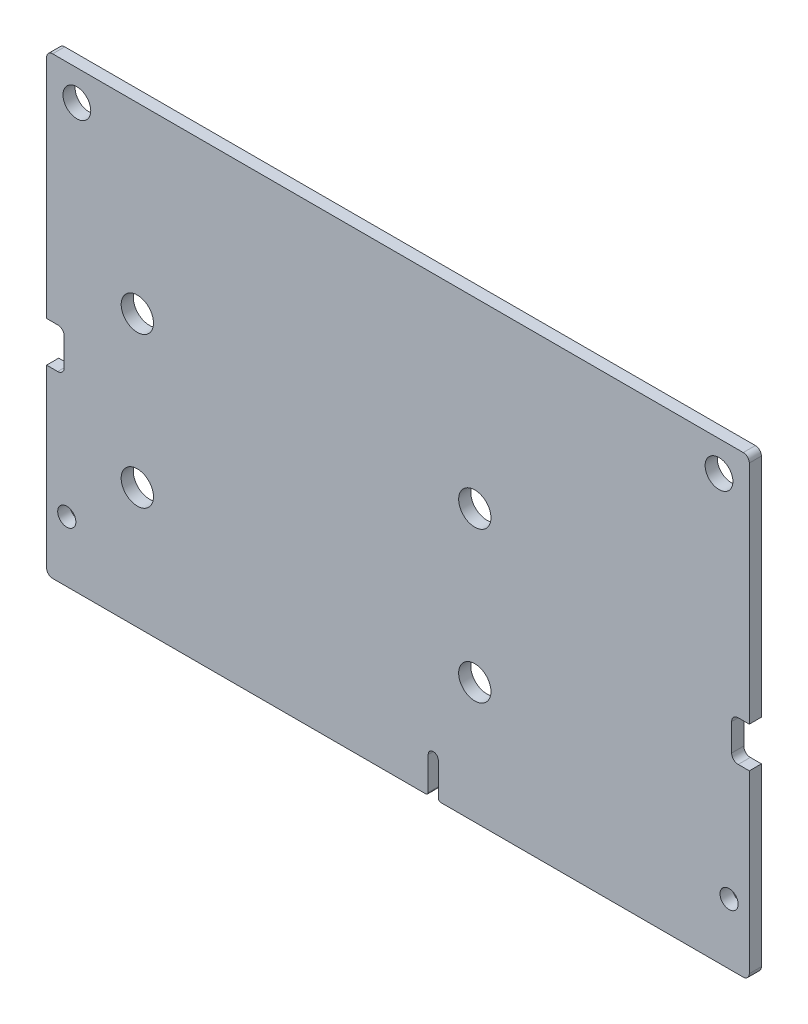
ISO-10303-21;
HEADER;
FILE_DESCRIPTION(('STEP AP214'),'2;1');
FILE_NAME('part.step','',(''),(''),'','','');
FILE_SCHEMA(('AUTOMOTIVE_DESIGN { 1 0 10303 214 1 1 1 1 }'));
ENDSEC;
DATA;
#1=APPLICATION_CONTEXT('core data for automotive mechanical design processes');
#2=APPLICATION_PROTOCOL_DEFINITION('international standard','automotive_design',2000,#1);
#3=PRODUCT_CONTEXT('',#1,'mechanical');
#4=PRODUCT('Part','Part','',(#3));
#5=PRODUCT_RELATED_PRODUCT_CATEGORY('part','',(#4));
#6=PRODUCT_DEFINITION_FORMATION('','',#4);
#7=PRODUCT_DEFINITION_CONTEXT('part definition',#1,'design');
#8=PRODUCT_DEFINITION('design','',#6,#7);
#9=PRODUCT_DEFINITION_SHAPE('','',#8);
#10=(LENGTH_UNIT() NAMED_UNIT(*) SI_UNIT(.MILLI.,.METRE.));
#11=(NAMED_UNIT(*) PLANE_ANGLE_UNIT() SI_UNIT($,.RADIAN.));
#12=(NAMED_UNIT(*) SI_UNIT($,.STERADIAN.) SOLID_ANGLE_UNIT());
#13=UNCERTAINTY_MEASURE_WITH_UNIT(LENGTH_MEASURE(1.E-05),#10,'distance_accuracy_value','');
#14=(GEOMETRIC_REPRESENTATION_CONTEXT(3) GLOBAL_UNCERTAINTY_ASSIGNED_CONTEXT((#13)) GLOBAL_UNIT_ASSIGNED_CONTEXT((#10,
#11,#12)) REPRESENTATION_CONTEXT('',''));
#15=CARTESIAN_POINT('',(0.,0.,0.));
#16=DIRECTION('',(0.,0.,1.));
#17=DIRECTION('',(1.,0.,0.));
#18=AXIS2_PLACEMENT_3D('',#15,#16,#17);
#19=CARTESIAN_POINT('',(0.,0.,1.2));
#20=DIRECTION('',(0.,0.,1.));
#21=DIRECTION('',(1.,0.,0.));
#22=AXIS2_PLACEMENT_3D('',#19,#20,#21);
#23=PLANE('',#22);
#24=CARTESIAN_POINT('',(64.6,36.,1.2));
#25=DIRECTION('',(0.,0.,1.));
#26=DIRECTION('',(1.,0.,0.));
#27=AXIS2_PLACEMENT_3D('',#24,#25,#26);
#28=CIRCLE('',#27,1.375);
#29=CARTESIAN_POINT('',(65.975,36.,1.2));
#30=VERTEX_POINT('',#29);
#31=EDGE_CURVE('E439',#30,#30,#28,.F.);
#32=ORIENTED_EDGE('',*,*,#31,.T.);
#33=EDGE_LOOP('',(#32));
#34=FACE_BOUND('',#33,.T.);
#35=CARTESIAN_POINT('',(1.,36.,1.2));
#36=DIRECTION('',(0.,0.,1.));
#37=DIRECTION('',(1.,0.,0.));
#38=AXIS2_PLACEMENT_3D('',#35,#36,#37);
#39=CIRCLE('',#38,1.375);
#40=CARTESIAN_POINT('',(2.375,36.,1.2));
#41=VERTEX_POINT('',#40);
#42=EDGE_CURVE('E442',#41,#41,#39,.F.);
#43=ORIENTED_EDGE('',*,*,#42,.T.);
#44=EDGE_LOOP('',(#43));
#45=FACE_BOUND('',#44,.T.);
#46=CARTESIAN_POINT('',(40.41293346554,5.998154895188,1.2));
#47=DIRECTION('',(0.,0.,-1.));
#48=DIRECTION('',(-1.,0.,0.));
#49=AXIS2_PLACEMENT_3D('',#46,#47,#48);
#50=CIRCLE('',#49,1.6);
#51=CARTESIAN_POINT('',(38.81293346554,5.998154895188,1.2));
#52=VERTEX_POINT('',#51);
#53=EDGE_CURVE('E445',#52,#52,#50,.T.);
#54=ORIENTED_EDGE('',*,*,#53,.T.);
#55=EDGE_LOOP('',(#54));
#56=FACE_BOUND('',#55,.T.);
#57=CARTESIAN_POINT('',(40.41293346554,20.90184510481,1.2));
#58=DIRECTION('',(0.,0.,-1.));
#59=DIRECTION('',(-1.,0.,0.));
#60=AXIS2_PLACEMENT_3D('',#57,#58,#59);
#61=CIRCLE('',#60,1.6);
#62=CARTESIAN_POINT('',(38.81293346554,20.90184510481,1.2));
#63=VERTEX_POINT('',#62);
#64=EDGE_CURVE('E448',#63,#63,#61,.T.);
#65=ORIENTED_EDGE('',*,*,#64,.T.);
#66=EDGE_LOOP('',(#65));
#67=FACE_BOUND('',#66,.T.);
#68=CARTESIAN_POINT('',(6.987066534462,20.90184510481,1.2));
#69=DIRECTION('',(0.,0.,-1.));
#70=DIRECTION('',(-1.,0.,0.));
#71=AXIS2_PLACEMENT_3D('',#68,#69,#70);
#72=CIRCLE('',#71,1.6);
#73=CARTESIAN_POINT('',(5.387066534462,20.90184510481,1.2));
#74=VERTEX_POINT('',#73);
#75=EDGE_CURVE('E451',#74,#74,#72,.T.);
#76=ORIENTED_EDGE('',*,*,#75,.T.);
#77=EDGE_LOOP('',(#76));
#78=FACE_BOUND('',#77,.T.);
#79=CARTESIAN_POINT('',(6.987066534462,5.998154895188,1.2));
#80=DIRECTION('',(0.,0.,-1.));
#81=DIRECTION('',(-1.,0.,0.));
#82=AXIS2_PLACEMENT_3D('',#79,#80,#81);
#83=CIRCLE('',#82,1.6);
#84=CARTESIAN_POINT('',(5.387066534462,5.998154895188,1.2));
#85=VERTEX_POINT('',#84);
#86=EDGE_CURVE('E454',#85,#85,#83,.T.);
#87=ORIENTED_EDGE('',*,*,#86,.T.);
#88=EDGE_LOOP('',(#87));
#89=FACE_BOUND('',#88,.T.);
#90=CARTESIAN_POINT('',(0.,0.,1.2));
#91=DIRECTION('',(0.,0.,1.));
#92=DIRECTION('',(1.,0.,0.));
#93=AXIS2_PLACEMENT_3D('',#90,#91,#92);
#94=CIRCLE('',#93,0.9);
#95=CARTESIAN_POINT('',(0.9,0.,1.2));
#96=VERTEX_POINT('',#95);
#97=EDGE_CURVE('E457',#96,#96,#94,.F.);
#98=ORIENTED_EDGE('',*,*,#97,.T.);
#99=EDGE_LOOP('',(#98));
#100=FACE_BOUND('',#99,.T.);
#101=CARTESIAN_POINT('',(65.6,0.,1.2));
#102=DIRECTION('',(0.,0.,1.));
#103=DIRECTION('',(1.,0.,0.));
#104=AXIS2_PLACEMENT_3D('',#101,#102,#103);
#105=CIRCLE('',#104,0.9);
#106=CARTESIAN_POINT('',(66.5,0.,1.2));
#107=VERTEX_POINT('',#106);
#108=EDGE_CURVE('E290',#107,#107,#105,.F.);
#109=ORIENTED_EDGE('',*,*,#108,.T.);
#110=EDGE_LOOP('',(#109));
#111=FACE_BOUND('',#110,.T.);
#112=DIRECTION('',(1.,0.,0.));
#113=VECTOR('',#112,1.);
#114=CARTESIAN_POINT('',(67.6,39.,1.2));
#115=LINE('',#114,#113);
#116=CARTESIAN_POINT('',(-1.4,39.,1.2));
#117=VERTEX_POINT('',#116);
#118=CARTESIAN_POINT('',(67.,39.,1.2));
#119=VERTEX_POINT('',#118);
#120=EDGE_CURVE('E287',#117,#119,#115,.T.);
#121=ORIENTED_EDGE('',*,*,#120,.F.);
#122=CARTESIAN_POINT('',(-1.4,38.4,1.2));
#123=DIRECTION('',(0.,0.,-1.));
#124=DIRECTION('',(-1.,0.,0.));
#125=AXIS2_PLACEMENT_3D('',#122,#123,#124);
#126=CIRCLE('',#125,0.6);
#127=CARTESIAN_POINT('',(-2.,38.4,1.2));
#128=VERTEX_POINT('',#127);
#129=EDGE_CURVE('E20',#128,#117,#126,.T.);
#130=ORIENTED_EDGE('',*,*,#129,.F.);
#131=DIRECTION('',(0.,1.,0.));
#132=VECTOR('',#131,1.);
#133=CARTESIAN_POINT('',(-2.,39.,1.2));
#134=LINE('',#133,#132);
#135=CARTESIAN_POINT('',(-2.,16.,1.2));
#136=VERTEX_POINT('',#135);
#137=EDGE_CURVE('E172',#136,#128,#134,.T.);
#138=ORIENTED_EDGE('',*,*,#137,.F.);
#139=DIRECTION('',(1.,0.,0.));
#140=VECTOR('',#139,1.);
#141=CARTESIAN_POINT('',(-2.,16.,1.2));
#142=LINE('',#141,#140);
#143=CARTESIAN_POINT('',(-0.9,16.,1.2));
#144=VERTEX_POINT('',#143);
#145=EDGE_CURVE('E178',#144,#136,#142,.F.);
#146=ORIENTED_EDGE('',*,*,#145,.F.);
#147=CARTESIAN_POINT('',(-0.9,15.35,1.2));
#148=DIRECTION('',(0.,0.,1.));
#149=DIRECTION('',(1.,0.,0.));
#150=AXIS2_PLACEMENT_3D('',#147,#148,#149);
#151=CIRCLE('',#150,0.65);
#152=CARTESIAN_POINT('',(-0.25,15.35,1.2));
#153=VERTEX_POINT('',#152);
#154=EDGE_CURVE('E361',#144,#153,#151,.F.);
#155=ORIENTED_EDGE('',*,*,#154,.T.);
#156=DIRECTION('',(0.,1.,0.));
#157=VECTOR('',#156,1.);
#158=CARTESIAN_POINT('',(-0.25,15.35,1.2));
#159=LINE('',#158,#157);
#160=CARTESIAN_POINT('',(-0.25,12.65,1.2));
#161=VERTEX_POINT('',#160);
#162=EDGE_CURVE('E358',#161,#153,#159,.T.);
#163=ORIENTED_EDGE('',*,*,#162,.F.);
#164=CARTESIAN_POINT('',(-0.9,12.65,1.2));
#165=DIRECTION('',(0.,0.,1.));
#166=DIRECTION('',(1.,0.,0.));
#167=AXIS2_PLACEMENT_3D('',#164,#165,#166);
#168=CIRCLE('',#167,0.65);
#169=CARTESIAN_POINT('',(-0.9,12.,1.2));
#170=VERTEX_POINT('',#169);
#171=EDGE_CURVE('E355',#161,#170,#168,.F.);
#172=ORIENTED_EDGE('',*,*,#171,.T.);
#173=DIRECTION('',(1.,0.,0.));
#174=VECTOR('',#173,1.);
#175=CARTESIAN_POINT('',(-0.9,12.,1.2));
#176=LINE('',#175,#174);
#177=CARTESIAN_POINT('',(-2.,12.,1.2));
#178=VERTEX_POINT('',#177);
#179=EDGE_CURVE('E351',#178,#170,#176,.T.);
#180=ORIENTED_EDGE('',*,*,#179,.F.);
#181=DIRECTION('',(0.,1.,0.));
#182=VECTOR('',#181,1.);
#183=CARTESIAN_POINT('',(-2.,12.,1.2));
#184=LINE('',#183,#182);
#185=CARTESIAN_POINT('',(-2.,-5.4,1.2));
#186=VERTEX_POINT('',#185);
#187=EDGE_CURVE('E346',#186,#178,#184,.T.);
#188=ORIENTED_EDGE('',*,*,#187,.F.);
#189=CARTESIAN_POINT('',(-1.4,-5.4,1.2));
#190=DIRECTION('',(0.,0.,-1.));
#191=DIRECTION('',(-1.,0.,0.));
#192=AXIS2_PLACEMENT_3D('',#189,#190,#191);
#193=CIRCLE('',#192,0.6);
#194=CARTESIAN_POINT('',(-1.4,-6.,1.2));
#195=VERTEX_POINT('',#194);
#196=EDGE_CURVE('E343',#195,#186,#193,.T.);
#197=ORIENTED_EDGE('',*,*,#196,.F.);
#198=DIRECTION('',(1.,0.,0.));
#199=VECTOR('',#198,1.);
#200=CARTESIAN_POINT('',(-2.,-6.,1.2));
#201=LINE('',#200,#199);
#202=CARTESIAN_POINT('',(35.55,-6.,1.2));
#203=VERTEX_POINT('',#202);
#204=EDGE_CURVE('E340',#203,#195,#201,.F.);
#205=ORIENTED_EDGE('',*,*,#204,.F.);
#206=CARTESIAN_POINT('',(35.55,-5.75,1.2));
#207=DIRECTION('',(0.,0.,1.));
#208=DIRECTION('',(1.,0.,0.));
#209=AXIS2_PLACEMENT_3D('',#206,#207,#208);
#210=CIRCLE('',#209,0.25);
#211=CARTESIAN_POINT('',(35.8,-5.75,1.2));
#212=VERTEX_POINT('',#211);
#213=EDGE_CURVE('E337',#212,#203,#210,.F.);
#214=ORIENTED_EDGE('',*,*,#213,.F.);
#215=DIRECTION('',(0.,1.,0.));
#216=VECTOR('',#215,1.);
#217=CARTESIAN_POINT('',(35.8,-5.75,1.2));
#218=LINE('',#217,#216);
#219=CARTESIAN_POINT('',(35.8,-2.5,1.2));
#220=VERTEX_POINT('',#219);
#221=EDGE_CURVE('E334',#220,#212,#218,.F.);
#222=ORIENTED_EDGE('',*,*,#221,.F.);
#223=CARTESIAN_POINT('',(36.3,-2.5,1.2));
#224=DIRECTION('',(0.,0.,1.));
#225=DIRECTION('',(1.,0.,0.));
#226=AXIS2_PLACEMENT_3D('',#223,#224,#225);
#227=CIRCLE('',#226,0.5);
#228=CARTESIAN_POINT('',(36.8,-2.5,1.2));
#229=VERTEX_POINT('',#228);
#230=EDGE_CURVE('E331',#220,#229,#227,.F.);
#231=ORIENTED_EDGE('',*,*,#230,.T.);
#232=DIRECTION('',(0.,1.,0.));
#233=VECTOR('',#232,1.);
#234=CARTESIAN_POINT('',(36.8,-2.5,1.2));
#235=LINE('',#234,#233);
#236=CARTESIAN_POINT('',(36.8,-5.75,1.2));
#237=VERTEX_POINT('',#236);
#238=EDGE_CURVE('E327',#237,#229,#235,.T.);
#239=ORIENTED_EDGE('',*,*,#238,.F.);
#240=CARTESIAN_POINT('',(37.05,-5.75,1.2));
#241=DIRECTION('',(0.,0.,1.));
#242=DIRECTION('',(1.,0.,0.));
#243=AXIS2_PLACEMENT_3D('',#240,#241,#242);
#244=CIRCLE('',#243,0.25);
#245=CARTESIAN_POINT('',(37.05,-6.,1.2));
#246=VERTEX_POINT('',#245);
#247=EDGE_CURVE('E324',#246,#237,#244,.F.);
#248=ORIENTED_EDGE('',*,*,#247,.F.);
#249=DIRECTION('',(1.,0.,0.));
#250=VECTOR('',#249,1.);
#251=CARTESIAN_POINT('',(37.05,-6.,1.2));
#252=LINE('',#251,#250);
#253=CARTESIAN_POINT('',(67.,-6.,1.2));
#254=VERTEX_POINT('',#253);
#255=EDGE_CURVE('E321',#254,#246,#252,.F.);
#256=ORIENTED_EDGE('',*,*,#255,.F.);
#257=CARTESIAN_POINT('',(67.,-5.4,1.2));
#258=DIRECTION('',(0.,0.,-1.));
#259=DIRECTION('',(-1.,0.,0.));
#260=AXIS2_PLACEMENT_3D('',#257,#258,#259);
#261=CIRCLE('',#260,0.6);
#262=CARTESIAN_POINT('',(67.6,-5.4,1.2));
#263=VERTEX_POINT('',#262);
#264=EDGE_CURVE('E318',#263,#254,#261,.T.);
#265=ORIENTED_EDGE('',*,*,#264,.F.);
#266=DIRECTION('',(0.,1.,0.));
#267=VECTOR('',#266,1.);
#268=CARTESIAN_POINT('',(67.6,-6.,1.2));
#269=LINE('',#268,#267);
#270=CARTESIAN_POINT('',(67.6,12.,1.2));
#271=VERTEX_POINT('',#270);
#272=EDGE_CURVE('E315',#271,#263,#269,.F.);
#273=ORIENTED_EDGE('',*,*,#272,.F.);
#274=DIRECTION('',(1.,0.,0.));
#275=VECTOR('',#274,1.);
#276=CARTESIAN_POINT('',(67.6,12.,1.2));
#277=LINE('',#276,#275);
#278=CARTESIAN_POINT('',(66.5,12.,1.2));
#279=VERTEX_POINT('',#278);
#280=EDGE_CURVE('E310',#279,#271,#277,.T.);
#281=ORIENTED_EDGE('',*,*,#280,.F.);
#282=CARTESIAN_POINT('',(66.5,12.65,1.2));
#283=DIRECTION('',(0.,0.,1.));
#284=DIRECTION('',(1.,0.,0.));
#285=AXIS2_PLACEMENT_3D('',#282,#283,#284);
#286=CIRCLE('',#285,0.65);
#287=CARTESIAN_POINT('',(65.85,12.65,1.2));
#288=VERTEX_POINT('',#287);
#289=EDGE_CURVE('E307',#279,#288,#286,.F.);
#290=ORIENTED_EDGE('',*,*,#289,.T.);
#291=DIRECTION('',(0.,1.,0.));
#292=VECTOR('',#291,1.);
#293=CARTESIAN_POINT('',(65.85,12.65,1.2));
#294=LINE('',#293,#292);
#295=CARTESIAN_POINT('',(65.85,15.35,1.2));
#296=VERTEX_POINT('',#295);
#297=EDGE_CURVE('E303',#296,#288,#294,.F.);
#298=ORIENTED_EDGE('',*,*,#297,.F.);
#299=CARTESIAN_POINT('',(66.5,15.35,1.2));
#300=DIRECTION('',(0.,0.,1.));
#301=DIRECTION('',(1.,0.,0.));
#302=AXIS2_PLACEMENT_3D('',#299,#300,#301);
#303=CIRCLE('',#302,0.65);
#304=CARTESIAN_POINT('',(66.5,16.,1.2));
#305=VERTEX_POINT('',#304);
#306=EDGE_CURVE('E300',#296,#305,#303,.F.);
#307=ORIENTED_EDGE('',*,*,#306,.T.);
#308=DIRECTION('',(1.,0.,0.));
#309=VECTOR('',#308,1.);
#310=CARTESIAN_POINT('',(66.5,16.,1.2));
#311=LINE('',#310,#309);
#312=CARTESIAN_POINT('',(67.6,16.,1.2));
#313=VERTEX_POINT('',#312);
#314=EDGE_CURVE('E296',#313,#305,#311,.F.);
#315=ORIENTED_EDGE('',*,*,#314,.F.);
#316=DIRECTION('',(0.,1.,0.));
#317=VECTOR('',#316,1.);
#318=CARTESIAN_POINT('',(67.6,16.,1.2));
#319=LINE('',#318,#317);
#320=CARTESIAN_POINT('',(67.6,38.4,1.2));
#321=VERTEX_POINT('',#320);
#322=EDGE_CURVE('E201',#321,#313,#319,.F.);
#323=ORIENTED_EDGE('',*,*,#322,.F.);
#324=CARTESIAN_POINT('',(67.,38.4,1.2));
#325=DIRECTION('',(0.,0.,-1.));
#326=DIRECTION('',(-1.,0.,0.));
#327=AXIS2_PLACEMENT_3D('',#324,#325,#326);
#328=CIRCLE('',#327,0.6);
#329=EDGE_CURVE('E205',#119,#321,#328,.T.);
#330=ORIENTED_EDGE('',*,*,#329,.F.);
#331=EDGE_LOOP('',(#121,#130,#138,#146,#155,#163,#172,#180,#188,#197,#205,#214,#222,#231,#239,
#248,#256,#265,#273,#281,#290,#298,#307,#315,#323,#330));
#332=FACE_BOUND('',#331,.T.);
#333=ADVANCED_FACE('F17',(#34,#45,#56,#67,#78,#89,#100,#111,#332),#23,.T.);
#334=CARTESIAN_POINT('',(-1.4,38.4,2.76432));
#335=DIRECTION('',(0.,0.,-1.));
#336=DIRECTION('',(-1.,0.,0.));
#337=AXIS2_PLACEMENT_3D('',#334,#335,#336);
#338=CYLINDRICAL_SURFACE('',#337,0.6);
#339=DIRECTION('',(0.,0.,1.));
#340=VECTOR('',#339,1.);
#341=CARTESIAN_POINT('',(-1.4,39.,0.));
#342=LINE('',#341,#340);
#343=CARTESIAN_POINT('',(-1.4,39.,0.));
#344=VERTEX_POINT('',#343);
#345=EDGE_CURVE('E286',#344,#117,#342,.T.);
#346=ORIENTED_EDGE('',*,*,#345,.F.);
#347=CARTESIAN_POINT('',(-1.4,38.4,0.));
#348=DIRECTION('',(0.,0.,-1.));
#349=DIRECTION('',(-1.,0.,0.));
#350=AXIS2_PLACEMENT_3D('',#347,#348,#349);
#351=CIRCLE('',#350,0.6);
#352=CARTESIAN_POINT('',(-2.,38.4,0.));
#353=VERTEX_POINT('',#352);
#354=EDGE_CURVE('E282',#344,#353,#351,.F.);
#355=ORIENTED_EDGE('',*,*,#354,.T.);
#356=DIRECTION('',(0.,0.,1.));
#357=VECTOR('',#356,1.);
#358=CARTESIAN_POINT('',(-2.,38.4,0.));
#359=LINE('',#358,#357);
#360=EDGE_CURVE('E366',#128,#353,#359,.F.);
#361=ORIENTED_EDGE('',*,*,#360,.F.);
#362=ORIENTED_EDGE('',*,*,#129,.T.);
#363=EDGE_LOOP('',(#346,#355,#361,#362));
#364=FACE_BOUND('',#363,.T.);
#365=ADVANCED_FACE('F633',(#364),#338,.T.);
#366=CARTESIAN_POINT('',(-2.,39.,0.));
#367=DIRECTION('',(-1.,0.,0.));
#368=DIRECTION('',(0.,0.,1.));
#369=AXIS2_PLACEMENT_3D('',#366,#367,#368);
#370=PLANE('',#369);
#371=ORIENTED_EDGE('',*,*,#137,.T.);
#372=ORIENTED_EDGE('',*,*,#360,.T.);
#373=DIRECTION('',(0.,1.,0.));
#374=VECTOR('',#373,1.);
#375=CARTESIAN_POINT('',(-2.,0.,0.));
#376=LINE('',#375,#374);
#377=CARTESIAN_POINT('',(-2.,16.,0.));
#378=VERTEX_POINT('',#377);
#379=EDGE_CURVE('E277',#353,#378,#376,.F.);
#380=ORIENTED_EDGE('',*,*,#379,.T.);
#381=DIRECTION('',(0.,0.,-1.));
#382=VECTOR('',#381,1.);
#383=CARTESIAN_POINT('',(-2.,16.,0.));
#384=LINE('',#383,#382);
#385=EDGE_CURVE('E362',#136,#378,#384,.T.);
#386=ORIENTED_EDGE('',*,*,#385,.F.);
#387=EDGE_LOOP('',(#371,#372,#380,#386));
#388=FACE_BOUND('',#387,.T.);
#389=ADVANCED_FACE('F635',(#388),#370,.T.);
#390=CARTESIAN_POINT('',(-2.,16.,0.));
#391=DIRECTION('',(0.,-1.,0.));
#392=DIRECTION('',(0.,0.,-1.));
#393=AXIS2_PLACEMENT_3D('',#390,#391,#392);
#394=PLANE('',#393);
#395=ORIENTED_EDGE('',*,*,#385,.T.);
#396=DIRECTION('',(1.,0.,0.));
#397=VECTOR('',#396,1.);
#398=CARTESIAN_POINT('',(0.,16.,0.));
#399=LINE('',#398,#397);
#400=CARTESIAN_POINT('',(-0.9,16.,0.));
#401=VERTEX_POINT('',#400);
#402=EDGE_CURVE('E274',#378,#401,#399,.T.);
#403=ORIENTED_EDGE('',*,*,#402,.T.);
#404=DIRECTION('',(0.,0.,1.));
#405=VECTOR('',#404,1.);
#406=CARTESIAN_POINT('',(-0.9,16.,0.));
#407=LINE('',#406,#405);
#408=EDGE_CURVE('E359',#401,#144,#407,.T.);
#409=ORIENTED_EDGE('',*,*,#408,.T.);
#410=ORIENTED_EDGE('',*,*,#145,.T.);
#411=EDGE_LOOP('',(#395,#403,#409,#410));
#412=FACE_BOUND('',#411,.T.);
#413=ADVANCED_FACE('F636',(#412),#394,.T.);
#414=CARTESIAN_POINT('',(-0.9,15.35,0.));
#415=DIRECTION('',(0.,0.,1.));
#416=DIRECTION('',(1.,0.,0.));
#417=AXIS2_PLACEMENT_3D('',#414,#415,#416);
#418=CYLINDRICAL_SURFACE('',#417,0.65);
#419=ORIENTED_EDGE('',*,*,#154,.F.);
#420=ORIENTED_EDGE('',*,*,#408,.F.);
#421=CARTESIAN_POINT('',(-0.9,15.35,0.));
#422=DIRECTION('',(0.,0.,1.));
#423=DIRECTION('',(1.,0.,0.));
#424=AXIS2_PLACEMENT_3D('',#421,#422,#423);
#425=CIRCLE('',#424,0.65);
#426=CARTESIAN_POINT('',(-0.25,15.35,0.));
#427=VERTEX_POINT('',#426);
#428=EDGE_CURVE('E273',#401,#427,#425,.F.);
#429=ORIENTED_EDGE('',*,*,#428,.T.);
#430=DIRECTION('',(0.,0.,1.));
#431=VECTOR('',#430,1.);
#432=CARTESIAN_POINT('',(-0.25,15.35,0.));
#433=LINE('',#432,#431);
#434=EDGE_CURVE('E356',#153,#427,#433,.F.);
#435=ORIENTED_EDGE('',*,*,#434,.F.);
#436=EDGE_LOOP('',(#419,#420,#429,#435));
#437=FACE_BOUND('',#436,.T.);
#438=ADVANCED_FACE('F481',(#437),#418,.F.);
#439=CARTESIAN_POINT('',(-0.25,15.35,0.));
#440=DIRECTION('',(-1.,0.,0.));
#441=DIRECTION('',(0.,0.,1.));
#442=AXIS2_PLACEMENT_3D('',#439,#440,#441);
#443=PLANE('',#442);
#444=ORIENTED_EDGE('',*,*,#434,.T.);
#445=DIRECTION('',(0.,1.,0.));
#446=VECTOR('',#445,1.);
#447=CARTESIAN_POINT('',(-0.25,0.,0.));
#448=LINE('',#447,#446);
#449=CARTESIAN_POINT('',(-0.25,12.65,0.));
#450=VERTEX_POINT('',#449);
#451=EDGE_CURVE('E270',#427,#450,#448,.F.);
#452=ORIENTED_EDGE('',*,*,#451,.T.);
#453=DIRECTION('',(0.,0.,1.));
#454=VECTOR('',#453,1.);
#455=CARTESIAN_POINT('',(-0.25,12.65,0.));
#456=LINE('',#455,#454);
#457=EDGE_CURVE('E352',#450,#161,#456,.T.);
#458=ORIENTED_EDGE('',*,*,#457,.T.);
#459=ORIENTED_EDGE('',*,*,#162,.T.);
#460=EDGE_LOOP('',(#444,#452,#458,#459));
#461=FACE_BOUND('',#460,.T.);
#462=ADVANCED_FACE('F485',(#461),#443,.T.);
#463=CARTESIAN_POINT('',(-0.9,12.65,0.));
#464=DIRECTION('',(0.,0.,1.));
#465=DIRECTION('',(1.,0.,0.));
#466=AXIS2_PLACEMENT_3D('',#463,#464,#465);
#467=CYLINDRICAL_SURFACE('',#466,0.65);
#468=ORIENTED_EDGE('',*,*,#171,.F.);
#469=ORIENTED_EDGE('',*,*,#457,.F.);
#470=CARTESIAN_POINT('',(-0.9,12.65,0.));
#471=DIRECTION('',(0.,0.,1.));
#472=DIRECTION('',(1.,0.,0.));
#473=AXIS2_PLACEMENT_3D('',#470,#471,#472);
#474=CIRCLE('',#473,0.65);
#475=CARTESIAN_POINT('',(-0.9,12.,0.));
#476=VERTEX_POINT('',#475);
#477=EDGE_CURVE('E267',#450,#476,#474,.F.);
#478=ORIENTED_EDGE('',*,*,#477,.T.);
#479=DIRECTION('',(0.,0.,1.));
#480=VECTOR('',#479,1.);
#481=CARTESIAN_POINT('',(-0.9,12.,0.));
#482=LINE('',#481,#480);
#483=EDGE_CURVE('E349',#170,#476,#482,.F.);
#484=ORIENTED_EDGE('',*,*,#483,.F.);
#485=EDGE_LOOP('',(#468,#469,#478,#484));
#486=FACE_BOUND('',#485,.T.);
#487=ADVANCED_FACE('F492',(#486),#467,.F.);
#488=CARTESIAN_POINT('',(-0.9,12.,0.));
#489=DIRECTION('',(0.,1.,0.));
#490=DIRECTION('',(0.,0.,1.));
#491=AXIS2_PLACEMENT_3D('',#488,#489,#490);
#492=PLANE('',#491);
#493=ORIENTED_EDGE('',*,*,#483,.T.);
#494=DIRECTION('',(1.,0.,0.));
#495=VECTOR('',#494,1.);
#496=CARTESIAN_POINT('',(0.,12.,0.));
#497=LINE('',#496,#495);
#498=CARTESIAN_POINT('',(-2.,12.,0.));
#499=VERTEX_POINT('',#498);
#500=EDGE_CURVE('E262',#476,#499,#497,.F.);
#501=ORIENTED_EDGE('',*,*,#500,.T.);
#502=DIRECTION('',(0.,0.,1.));
#503=VECTOR('',#502,1.);
#504=CARTESIAN_POINT('',(-2.,12.,0.));
#505=LINE('',#504,#503);
#506=EDGE_CURVE('E344',#178,#499,#505,.F.);
#507=ORIENTED_EDGE('',*,*,#506,.F.);
#508=ORIENTED_EDGE('',*,*,#179,.T.);
#509=EDGE_LOOP('',(#493,#501,#507,#508));
#510=FACE_BOUND('',#509,.T.);
#511=ADVANCED_FACE('F499',(#510),#492,.T.);
#512=CARTESIAN_POINT('',(-2.,12.,0.));
#513=DIRECTION('',(-1.,0.,0.));
#514=DIRECTION('',(0.,0.,1.));
#515=AXIS2_PLACEMENT_3D('',#512,#513,#514);
#516=PLANE('',#515);
#517=DIRECTION('',(0.,1.,0.));
#518=VECTOR('',#517,1.);
#519=CARTESIAN_POINT('',(-2.,0.,0.));
#520=LINE('',#519,#518);
#521=CARTESIAN_POINT('',(-2.,-5.4,0.));
#522=VERTEX_POINT('',#521);
#523=EDGE_CURVE('E259',#499,#522,#520,.F.);
#524=ORIENTED_EDGE('',*,*,#523,.T.);
#525=DIRECTION('',(0.,0.,-1.));
#526=VECTOR('',#525,1.);
#527=CARTESIAN_POINT('',(-2.,-5.4,2.76432));
#528=LINE('',#527,#526);
#529=EDGE_CURVE('E341',#186,#522,#528,.T.);
#530=ORIENTED_EDGE('',*,*,#529,.F.);
#531=ORIENTED_EDGE('',*,*,#187,.T.);
#532=ORIENTED_EDGE('',*,*,#506,.T.);
#533=EDGE_LOOP('',(#524,#530,#531,#532));
#534=FACE_BOUND('',#533,.T.);
#535=ADVANCED_FACE('F501',(#534),#516,.T.);
#536=CARTESIAN_POINT('',(-1.4,-5.4,2.76432));
#537=DIRECTION('',(0.,0.,-1.));
#538=DIRECTION('',(-1.,0.,0.));
#539=AXIS2_PLACEMENT_3D('',#536,#537,#538);
#540=CYLINDRICAL_SURFACE('',#539,0.6);
#541=ORIENTED_EDGE('',*,*,#529,.T.);
#542=CARTESIAN_POINT('',(-1.4,-5.4,0.));
#543=DIRECTION('',(0.,0.,-1.));
#544=DIRECTION('',(-1.,0.,0.));
#545=AXIS2_PLACEMENT_3D('',#542,#543,#544);
#546=CIRCLE('',#545,0.6);
#547=CARTESIAN_POINT('',(-1.4,-6.,0.));
#548=VERTEX_POINT('',#547);
#549=EDGE_CURVE('E258',#522,#548,#546,.F.);
#550=ORIENTED_EDGE('',*,*,#549,.T.);
#551=DIRECTION('',(0.,0.,-1.));
#552=VECTOR('',#551,1.);
#553=CARTESIAN_POINT('',(-1.4,-6.,0.));
#554=LINE('',#553,#552);
#555=EDGE_CURVE('E338',#195,#548,#554,.T.);
#556=ORIENTED_EDGE('',*,*,#555,.F.);
#557=ORIENTED_EDGE('',*,*,#196,.T.);
#558=EDGE_LOOP('',(#541,#550,#556,#557));
#559=FACE_BOUND('',#558,.T.);
#560=ADVANCED_FACE('F507',(#559),#540,.T.);
#561=CARTESIAN_POINT('',(-2.,-6.,0.));
#562=DIRECTION('',(0.,-1.,0.));
#563=DIRECTION('',(0.,0.,-1.));
#564=AXIS2_PLACEMENT_3D('',#561,#562,#563);
#565=PLANE('',#564);
#566=ORIENTED_EDGE('',*,*,#555,.T.);
#567=DIRECTION('',(1.,0.,0.));
#568=VECTOR('',#567,1.);
#569=CARTESIAN_POINT('',(0.,-6.,0.));
#570=LINE('',#569,#568);
#571=CARTESIAN_POINT('',(35.55,-6.,0.));
#572=VERTEX_POINT('',#571);
#573=EDGE_CURVE('E255',#548,#572,#570,.T.);
#574=ORIENTED_EDGE('',*,*,#573,.T.);
#575=DIRECTION('',(0.,0.,1.));
#576=VECTOR('',#575,1.);
#577=CARTESIAN_POINT('',(35.55,-6.,0.));
#578=LINE('',#577,#576);
#579=EDGE_CURVE('E335',#203,#572,#578,.F.);
#580=ORIENTED_EDGE('',*,*,#579,.F.);
#581=ORIENTED_EDGE('',*,*,#204,.T.);
#582=EDGE_LOOP('',(#566,#574,#580,#581));
#583=FACE_BOUND('',#582,.T.);
#584=ADVANCED_FACE('F513',(#583),#565,.T.);
#585=CARTESIAN_POINT('',(35.55,-5.75,0.));
#586=DIRECTION('',(0.,0.,1.));
#587=DIRECTION('',(1.,0.,0.));
#588=AXIS2_PLACEMENT_3D('',#585,#586,#587);
#589=CYLINDRICAL_SURFACE('',#588,0.25);
#590=ORIENTED_EDGE('',*,*,#579,.T.);
#591=CARTESIAN_POINT('',(35.55,-5.75,0.));
#592=DIRECTION('',(0.,0.,1.));
#593=DIRECTION('',(1.,0.,0.));
#594=AXIS2_PLACEMENT_3D('',#591,#592,#593);
#595=CIRCLE('',#594,0.25);
#596=CARTESIAN_POINT('',(35.8,-5.75,0.));
#597=VERTEX_POINT('',#596);
#598=EDGE_CURVE('E254',#572,#597,#595,.T.);
#599=ORIENTED_EDGE('',*,*,#598,.T.);
#600=DIRECTION('',(0.,0.,-1.));
#601=VECTOR('',#600,1.);
#602=CARTESIAN_POINT('',(35.8,-5.75,0.));
#603=LINE('',#602,#601);
#604=EDGE_CURVE('E332',#212,#597,#603,.T.);
#605=ORIENTED_EDGE('',*,*,#604,.F.);
#606=ORIENTED_EDGE('',*,*,#213,.T.);
#607=EDGE_LOOP('',(#590,#599,#605,#606));
#608=FACE_BOUND('',#607,.T.);
#609=ADVANCED_FACE('F515',(#608),#589,.T.);
#610=CARTESIAN_POINT('',(35.8,-5.75,0.));
#611=DIRECTION('',(1.,0.,0.));
#612=DIRECTION('',(0.,0.,-1.));
#613=AXIS2_PLACEMENT_3D('',#610,#611,#612);
#614=PLANE('',#613);
#615=ORIENTED_EDGE('',*,*,#604,.T.);
#616=DIRECTION('',(0.,1.,0.));
#617=VECTOR('',#616,1.);
#618=CARTESIAN_POINT('',(35.8,0.,0.));
#619=LINE('',#618,#617);
#620=CARTESIAN_POINT('',(35.8,-2.5,0.));
#621=VERTEX_POINT('',#620);
#622=EDGE_CURVE('E251',#597,#621,#619,.T.);
#623=ORIENTED_EDGE('',*,*,#622,.T.);
#624=DIRECTION('',(0.,0.,1.));
#625=VECTOR('',#624,1.);
#626=CARTESIAN_POINT('',(35.8,-2.5,0.));
#627=LINE('',#626,#625);
#628=EDGE_CURVE('E328',#621,#220,#627,.T.);
#629=ORIENTED_EDGE('',*,*,#628,.T.);
#630=ORIENTED_EDGE('',*,*,#221,.T.);
#631=EDGE_LOOP('',(#615,#623,#629,#630));
#632=FACE_BOUND('',#631,.T.);
#633=ADVANCED_FACE('F520',(#632),#614,.T.);
#634=CARTESIAN_POINT('',(36.3,-2.5,0.));
#635=DIRECTION('',(0.,0.,1.));
#636=DIRECTION('',(1.,0.,0.));
#637=AXIS2_PLACEMENT_3D('',#634,#635,#636);
#638=CYLINDRICAL_SURFACE('',#637,0.5);
#639=ORIENTED_EDGE('',*,*,#230,.F.);
#640=ORIENTED_EDGE('',*,*,#628,.F.);
#641=CARTESIAN_POINT('',(36.3,-2.5,0.));
#642=DIRECTION('',(0.,0.,1.));
#643=DIRECTION('',(1.,0.,0.));
#644=AXIS2_PLACEMENT_3D('',#641,#642,#643);
#645=CIRCLE('',#644,0.5);
#646=CARTESIAN_POINT('',(36.8,-2.5,0.));
#647=VERTEX_POINT('',#646);
#648=EDGE_CURVE('E250',#621,#647,#645,.F.);
#649=ORIENTED_EDGE('',*,*,#648,.T.);
#650=DIRECTION('',(0.,0.,1.));
#651=VECTOR('',#650,1.);
#652=CARTESIAN_POINT('',(36.8,-2.5,0.));
#653=LINE('',#652,#651);
#654=EDGE_CURVE('E325',#229,#647,#653,.F.);
#655=ORIENTED_EDGE('',*,*,#654,.F.);
#656=EDGE_LOOP('',(#639,#640,#649,#655));
#657=FACE_BOUND('',#656,.T.);
#658=ADVANCED_FACE('F525',(#657),#638,.F.);
#659=CARTESIAN_POINT('',(36.8,-2.5,0.));
#660=DIRECTION('',(-1.,0.,0.));
#661=DIRECTION('',(0.,0.,1.));
#662=AXIS2_PLACEMENT_3D('',#659,#660,#661);
#663=PLANE('',#662);
#664=ORIENTED_EDGE('',*,*,#654,.T.);
#665=DIRECTION('',(0.,1.,0.));
#666=VECTOR('',#665,1.);
#667=CARTESIAN_POINT('',(36.8,0.,0.));
#668=LINE('',#667,#666);
#669=CARTESIAN_POINT('',(36.8,-5.75,0.));
#670=VERTEX_POINT('',#669);
#671=EDGE_CURVE('E247',#647,#670,#668,.F.);
#672=ORIENTED_EDGE('',*,*,#671,.T.);
#673=DIRECTION('',(0.,0.,1.));
#674=VECTOR('',#673,1.);
#675=CARTESIAN_POINT('',(36.8,-5.75,0.));
#676=LINE('',#675,#674);
#677=EDGE_CURVE('E322',#237,#670,#676,.F.);
#678=ORIENTED_EDGE('',*,*,#677,.F.);
#679=ORIENTED_EDGE('',*,*,#238,.T.);
#680=EDGE_LOOP('',(#664,#672,#678,#679));
#681=FACE_BOUND('',#680,.T.);
#682=ADVANCED_FACE('F527',(#681),#663,.T.);
#683=CARTESIAN_POINT('',(37.05,-5.75,0.));
#684=DIRECTION('',(0.,0.,1.));
#685=DIRECTION('',(1.,0.,0.));
#686=AXIS2_PLACEMENT_3D('',#683,#684,#685);
#687=CYLINDRICAL_SURFACE('',#686,0.25);
#688=ORIENTED_EDGE('',*,*,#677,.T.);
#689=CARTESIAN_POINT('',(37.05,-5.75,0.));
#690=DIRECTION('',(0.,0.,1.));
#691=DIRECTION('',(1.,0.,0.));
#692=AXIS2_PLACEMENT_3D('',#689,#690,#691);
#693=CIRCLE('',#692,0.25);
#694=CARTESIAN_POINT('',(37.05,-6.,0.));
#695=VERTEX_POINT('',#694);
#696=EDGE_CURVE('E246',#670,#695,#693,.T.);
#697=ORIENTED_EDGE('',*,*,#696,.T.);
#698=DIRECTION('',(0.,0.,-1.));
#699=VECTOR('',#698,1.);
#700=CARTESIAN_POINT('',(37.05,-6.,0.));
#701=LINE('',#700,#699);
#702=EDGE_CURVE('E319',#246,#695,#701,.T.);
#703=ORIENTED_EDGE('',*,*,#702,.F.);
#704=ORIENTED_EDGE('',*,*,#247,.T.);
#705=EDGE_LOOP('',(#688,#697,#703,#704));
#706=FACE_BOUND('',#705,.T.);
#707=ADVANCED_FACE('F534',(#706),#687,.T.);
#708=CARTESIAN_POINT('',(37.05,-6.,0.));
#709=DIRECTION('',(0.,-1.,0.));
#710=DIRECTION('',(0.,0.,-1.));
#711=AXIS2_PLACEMENT_3D('',#708,#709,#710);
#712=PLANE('',#711);
#713=DIRECTION('',(1.,0.,0.));
#714=VECTOR('',#713,1.);
#715=CARTESIAN_POINT('',(0.,-6.,0.));
#716=LINE('',#715,#714);
#717=CARTESIAN_POINT('',(67.,-6.,0.));
#718=VERTEX_POINT('',#717);
#719=EDGE_CURVE('E243',#695,#718,#716,.T.);
#720=ORIENTED_EDGE('',*,*,#719,.T.);
#721=DIRECTION('',(0.,0.,-1.));
#722=VECTOR('',#721,1.);
#723=CARTESIAN_POINT('',(67.,-6.,2.76432));
#724=LINE('',#723,#722);
#725=EDGE_CURVE('E316',#254,#718,#724,.T.);
#726=ORIENTED_EDGE('',*,*,#725,.F.);
#727=ORIENTED_EDGE('',*,*,#255,.T.);
#728=ORIENTED_EDGE('',*,*,#702,.T.);
#729=EDGE_LOOP('',(#720,#726,#727,#728));
#730=FACE_BOUND('',#729,.T.);
#731=ADVANCED_FACE('F542',(#730),#712,.T.);
#732=CARTESIAN_POINT('',(67.,-5.4,2.76432));
#733=DIRECTION('',(0.,0.,-1.));
#734=DIRECTION('',(-1.,0.,0.));
#735=AXIS2_PLACEMENT_3D('',#732,#733,#734);
#736=CYLINDRICAL_SURFACE('',#735,0.6);
#737=ORIENTED_EDGE('',*,*,#725,.T.);
#738=CARTESIAN_POINT('',(67.,-5.4,0.));
#739=DIRECTION('',(0.,0.,-1.));
#740=DIRECTION('',(-1.,0.,0.));
#741=AXIS2_PLACEMENT_3D('',#738,#739,#740);
#742=CIRCLE('',#741,0.6);
#743=CARTESIAN_POINT('',(67.6,-5.4,0.));
#744=VERTEX_POINT('',#743);
#745=EDGE_CURVE('E240',#718,#744,#742,.F.);
#746=ORIENTED_EDGE('',*,*,#745,.T.);
#747=DIRECTION('',(0.,0.,-1.));
#748=VECTOR('',#747,1.);
#749=CARTESIAN_POINT('',(67.6,-5.4,0.));
#750=LINE('',#749,#748);
#751=EDGE_CURVE('E313',#263,#744,#750,.T.);
#752=ORIENTED_EDGE('',*,*,#751,.F.);
#753=ORIENTED_EDGE('',*,*,#264,.T.);
#754=EDGE_LOOP('',(#737,#746,#752,#753));
#755=FACE_BOUND('',#754,.T.);
#756=ADVANCED_FACE('F544',(#755),#736,.T.);
#757=CARTESIAN_POINT('',(67.6,-6.,0.));
#758=DIRECTION('',(1.,0.,0.));
#759=DIRECTION('',(0.,0.,-1.));
#760=AXIS2_PLACEMENT_3D('',#757,#758,#759);
#761=PLANE('',#760);
#762=ORIENTED_EDGE('',*,*,#751,.T.);
#763=DIRECTION('',(0.,1.,0.));
#764=VECTOR('',#763,1.);
#765=CARTESIAN_POINT('',(67.6,0.,0.));
#766=LINE('',#765,#764);
#767=CARTESIAN_POINT('',(67.6,12.,0.));
#768=VERTEX_POINT('',#767);
#769=EDGE_CURVE('E235',#744,#768,#766,.T.);
#770=ORIENTED_EDGE('',*,*,#769,.T.);
#771=DIRECTION('',(0.,0.,1.));
#772=VECTOR('',#771,1.);
#773=CARTESIAN_POINT('',(67.6,12.,0.));
#774=LINE('',#773,#772);
#775=EDGE_CURVE('E308',#271,#768,#774,.F.);
#776=ORIENTED_EDGE('',*,*,#775,.F.);
#777=ORIENTED_EDGE('',*,*,#272,.T.);
#778=EDGE_LOOP('',(#762,#770,#776,#777));
#779=FACE_BOUND('',#778,.T.);
#780=ADVANCED_FACE('F550',(#779),#761,.T.);
#781=CARTESIAN_POINT('',(67.6,12.,0.));
#782=DIRECTION('',(0.,1.,0.));
#783=DIRECTION('',(0.,0.,1.));
#784=AXIS2_PLACEMENT_3D('',#781,#782,#783);
#785=PLANE('',#784);
#786=ORIENTED_EDGE('',*,*,#775,.T.);
#787=DIRECTION('',(1.,0.,0.));
#788=VECTOR('',#787,1.);
#789=CARTESIAN_POINT('',(0.,12.,0.));
#790=LINE('',#789,#788);
#791=CARTESIAN_POINT('',(66.5,12.,0.));
#792=VERTEX_POINT('',#791);
#793=EDGE_CURVE('E232',#768,#792,#790,.F.);
#794=ORIENTED_EDGE('',*,*,#793,.T.);
#795=DIRECTION('',(0.,0.,1.));
#796=VECTOR('',#795,1.);
#797=CARTESIAN_POINT('',(66.5,12.,0.));
#798=LINE('',#797,#796);
#799=EDGE_CURVE('E304',#792,#279,#798,.T.);
#800=ORIENTED_EDGE('',*,*,#799,.T.);
#801=ORIENTED_EDGE('',*,*,#280,.T.);
#802=EDGE_LOOP('',(#786,#794,#800,#801));
#803=FACE_BOUND('',#802,.T.);
#804=ADVANCED_FACE('F556',(#803),#785,.T.);
#805=CARTESIAN_POINT('',(66.5,12.65,0.));
#806=DIRECTION('',(0.,0.,1.));
#807=DIRECTION('',(1.,0.,0.));
#808=AXIS2_PLACEMENT_3D('',#805,#806,#807);
#809=CYLINDRICAL_SURFACE('',#808,0.65);
#810=ORIENTED_EDGE('',*,*,#289,.F.);
#811=ORIENTED_EDGE('',*,*,#799,.F.);
#812=CARTESIAN_POINT('',(66.5,12.65,0.));
#813=DIRECTION('',(0.,0.,1.));
#814=DIRECTION('',(1.,0.,0.));
#815=AXIS2_PLACEMENT_3D('',#812,#813,#814);
#816=CIRCLE('',#815,0.65);
#817=CARTESIAN_POINT('',(65.85,12.65,0.));
#818=VERTEX_POINT('',#817);
#819=EDGE_CURVE('E231',#792,#818,#816,.F.);
#820=ORIENTED_EDGE('',*,*,#819,.T.);
#821=DIRECTION('',(0.,0.,-1.));
#822=VECTOR('',#821,1.);
#823=CARTESIAN_POINT('',(65.85,12.65,0.));
#824=LINE('',#823,#822);
#825=EDGE_CURVE('E301',#288,#818,#824,.T.);
#826=ORIENTED_EDGE('',*,*,#825,.F.);
#827=EDGE_LOOP('',(#810,#811,#820,#826));
#828=FACE_BOUND('',#827,.T.);
#829=ADVANCED_FACE('F555',(#828),#809,.F.);
#830=CARTESIAN_POINT('',(65.85,12.65,0.));
#831=DIRECTION('',(1.,0.,0.));
#832=DIRECTION('',(0.,0.,-1.));
#833=AXIS2_PLACEMENT_3D('',#830,#831,#832);
#834=PLANE('',#833);
#835=ORIENTED_EDGE('',*,*,#825,.T.);
#836=DIRECTION('',(0.,1.,0.));
#837=VECTOR('',#836,1.);
#838=CARTESIAN_POINT('',(65.85,0.,0.));
#839=LINE('',#838,#837);
#840=CARTESIAN_POINT('',(65.85,15.35,0.));
#841=VERTEX_POINT('',#840);
#842=EDGE_CURVE('E222',#818,#841,#839,.T.);
#843=ORIENTED_EDGE('',*,*,#842,.T.);
#844=DIRECTION('',(0.,0.,1.));
#845=VECTOR('',#844,1.);
#846=CARTESIAN_POINT('',(65.85,15.35,0.));
#847=LINE('',#846,#845);
#848=EDGE_CURVE('E297',#841,#296,#847,.T.);
#849=ORIENTED_EDGE('',*,*,#848,.T.);
#850=ORIENTED_EDGE('',*,*,#297,.T.);
#851=EDGE_LOOP('',(#835,#843,#849,#850));
#852=FACE_BOUND('',#851,.T.);
#853=ADVANCED_FACE('F564',(#852),#834,.T.);
#854=CARTESIAN_POINT('',(66.5,15.35,0.));
#855=DIRECTION('',(0.,0.,1.));
#856=DIRECTION('',(1.,0.,0.));
#857=AXIS2_PLACEMENT_3D('',#854,#855,#856);
#858=CYLINDRICAL_SURFACE('',#857,0.65);
#859=ORIENTED_EDGE('',*,*,#306,.F.);
#860=ORIENTED_EDGE('',*,*,#848,.F.);
#861=CARTESIAN_POINT('',(66.5,15.35,0.));
#862=DIRECTION('',(0.,0.,1.));
#863=DIRECTION('',(1.,0.,0.));
#864=AXIS2_PLACEMENT_3D('',#861,#862,#863);
#865=CIRCLE('',#864,0.65);
#866=CARTESIAN_POINT('',(66.5,16.,0.));
#867=VERTEX_POINT('',#866);
#868=EDGE_CURVE('E220',#841,#867,#865,.F.);
#869=ORIENTED_EDGE('',*,*,#868,.T.);
#870=DIRECTION('',(0.,0.,-1.));
#871=VECTOR('',#870,1.);
#872=CARTESIAN_POINT('',(66.5,16.,0.));
#873=LINE('',#872,#871);
#874=EDGE_CURVE('E219',#305,#867,#873,.T.);
#875=ORIENTED_EDGE('',*,*,#874,.F.);
#876=EDGE_LOOP('',(#859,#860,#869,#875));
#877=FACE_BOUND('',#876,.T.);
#878=ADVANCED_FACE('F618',(#877),#858,.F.);
#879=CARTESIAN_POINT('',(66.5,16.,0.));
#880=DIRECTION('',(0.,-1.,0.));
#881=DIRECTION('',(0.,0.,-1.));
#882=AXIS2_PLACEMENT_3D('',#879,#880,#881);
#883=PLANE('',#882);
#884=ORIENTED_EDGE('',*,*,#874,.T.);
#885=DIRECTION('',(1.,0.,0.));
#886=VECTOR('',#885,1.);
#887=CARTESIAN_POINT('',(0.,16.,0.));
#888=LINE('',#887,#886);
#889=CARTESIAN_POINT('',(67.6,16.,0.));
#890=VERTEX_POINT('',#889);
#891=EDGE_CURVE('E212',#867,#890,#888,.T.);
#892=ORIENTED_EDGE('',*,*,#891,.T.);
#893=DIRECTION('',(0.,0.,-1.));
#894=VECTOR('',#893,1.);
#895=CARTESIAN_POINT('',(67.6,16.,0.));
#896=LINE('',#895,#894);
#897=EDGE_CURVE('E195',#313,#890,#896,.T.);
#898=ORIENTED_EDGE('',*,*,#897,.F.);
#899=ORIENTED_EDGE('',*,*,#314,.T.);
#900=EDGE_LOOP('',(#884,#892,#898,#899));
#901=FACE_BOUND('',#900,.T.);
#902=ADVANCED_FACE('F217',(#901),#883,.T.);
#903=CARTESIAN_POINT('',(67.6,16.,0.));
#904=DIRECTION('',(1.,0.,0.));
#905=DIRECTION('',(0.,0.,-1.));
#906=AXIS2_PLACEMENT_3D('',#903,#904,#905);
#907=PLANE('',#906);
#908=DIRECTION('',(0.,1.,0.));
#909=VECTOR('',#908,1.);
#910=CARTESIAN_POINT('',(67.6,0.,0.));
#911=LINE('',#910,#909);
#912=CARTESIAN_POINT('',(67.6,38.4,0.));
#913=VERTEX_POINT('',#912);
#914=EDGE_CURVE('E199',#890,#913,#911,.T.);
#915=ORIENTED_EDGE('',*,*,#914,.T.);
#916=DIRECTION('',(0.,0.,-1.));
#917=VECTOR('',#916,1.);
#918=CARTESIAN_POINT('',(67.6,38.4,2.76432));
#919=LINE('',#918,#917);
#920=EDGE_CURVE('E291',#321,#913,#919,.T.);
#921=ORIENTED_EDGE('',*,*,#920,.F.);
#922=ORIENTED_EDGE('',*,*,#322,.T.);
#923=ORIENTED_EDGE('',*,*,#897,.T.);
#924=EDGE_LOOP('',(#915,#921,#922,#923));
#925=FACE_BOUND('',#924,.T.);
#926=ADVANCED_FACE('F197',(#925),#907,.T.);
#927=CARTESIAN_POINT('',(67.,38.4,2.76432));
#928=DIRECTION('',(0.,0.,-1.));
#929=DIRECTION('',(-1.,0.,0.));
#930=AXIS2_PLACEMENT_3D('',#927,#928,#929);
#931=CYLINDRICAL_SURFACE('',#930,0.6);
#932=ORIENTED_EDGE('',*,*,#920,.T.);
#933=CARTESIAN_POINT('',(67.,38.4,0.));
#934=DIRECTION('',(0.,0.,-1.));
#935=DIRECTION('',(-1.,0.,0.));
#936=AXIS2_PLACEMENT_3D('',#933,#934,#935);
#937=CIRCLE('',#936,0.6);
#938=CARTESIAN_POINT('',(67.,39.,0.));
#939=VERTEX_POINT('',#938);
#940=EDGE_CURVE('E215',#913,#939,#937,.F.);
#941=ORIENTED_EDGE('',*,*,#940,.T.);
#942=DIRECTION('',(0.,0.,1.));
#943=VECTOR('',#942,1.);
#944=CARTESIAN_POINT('',(67.,39.,0.));
#945=LINE('',#944,#943);
#946=EDGE_CURVE('E35',#119,#939,#945,.F.);
#947=ORIENTED_EDGE('',*,*,#946,.F.);
#948=ORIENTED_EDGE('',*,*,#329,.T.);
#949=EDGE_LOOP('',(#932,#941,#947,#948));
#950=FACE_BOUND('',#949,.T.);
#951=ADVANCED_FACE('F610',(#950),#931,.T.);
#952=CARTESIAN_POINT('',(67.6,39.,0.));
#953=DIRECTION('',(0.,1.,0.));
#954=DIRECTION('',(0.,0.,1.));
#955=AXIS2_PLACEMENT_3D('',#952,#953,#954);
#956=PLANE('',#955);
#957=DIRECTION('',(1.,0.,0.));
#958=VECTOR('',#957,1.);
#959=CARTESIAN_POINT('',(0.,39.,0.));
#960=LINE('',#959,#958);
#961=EDGE_CURVE('E419',#939,#344,#960,.F.);
#962=ORIENTED_EDGE('',*,*,#961,.T.);
#963=ORIENTED_EDGE('',*,*,#345,.T.);
#964=ORIENTED_EDGE('',*,*,#120,.T.);
#965=ORIENTED_EDGE('',*,*,#946,.T.);
#966=EDGE_LOOP('',(#962,#963,#964,#965));
#967=FACE_BOUND('',#966,.T.);
#968=ADVANCED_FACE('F606',(#967),#956,.T.);
#969=CARTESIAN_POINT('',(65.6,0.,0.));
#970=DIRECTION('',(0.,0.,1.));
#971=DIRECTION('',(1.,0.,0.));
#972=AXIS2_PLACEMENT_3D('',#969,#970,#971);
#973=CYLINDRICAL_SURFACE('',#972,0.9);
#974=ORIENTED_EDGE('',*,*,#108,.F.);
#975=EDGE_LOOP('',(#974));
#976=FACE_BOUND('',#975,.T.);
#977=CARTESIAN_POINT('',(65.6,0.,0.));
#978=DIRECTION('',(0.,0.,1.));
#979=DIRECTION('',(1.,0.,0.));
#980=AXIS2_PLACEMENT_3D('',#977,#978,#979);
#981=CIRCLE('',#980,0.9);
#982=CARTESIAN_POINT('',(66.5,0.,0.));
#983=VERTEX_POINT('',#982);
#984=EDGE_CURVE('E416',#983,#983,#981,.F.);
#985=ORIENTED_EDGE('',*,*,#984,.T.);
#986=EDGE_LOOP('',(#985));
#987=FACE_BOUND('',#986,.T.);
#988=ADVANCED_FACE('F602',(#976,#987),#973,.F.);
#989=CARTESIAN_POINT('',(0.,0.,0.));
#990=DIRECTION('',(0.,0.,1.));
#991=DIRECTION('',(1.,0.,0.));
#992=AXIS2_PLACEMENT_3D('',#989,#990,#991);
#993=CYLINDRICAL_SURFACE('',#992,0.9);
#994=ORIENTED_EDGE('',*,*,#97,.F.);
#995=EDGE_LOOP('',(#994));
#996=FACE_BOUND('',#995,.T.);
#997=CARTESIAN_POINT('',(0.,0.,0.));
#998=DIRECTION('',(0.,0.,1.));
#999=DIRECTION('',(1.,0.,0.));
#1000=AXIS2_PLACEMENT_3D('',#997,#998,#999);
#1001=CIRCLE('',#1000,0.9);
#1002=CARTESIAN_POINT('',(0.9,0.,0.));
#1003=VERTEX_POINT('',#1002);
#1004=EDGE_CURVE('E413',#1003,#1003,#1001,.F.);
#1005=ORIENTED_EDGE('',*,*,#1004,.T.);
#1006=EDGE_LOOP('',(#1005));
#1007=FACE_BOUND('',#1006,.T.);
#1008=ADVANCED_FACE('F598',(#996,#1007),#993,.F.);
#1009=CARTESIAN_POINT('',(6.987066534462,5.998154895188,1.2));
#1010=DIRECTION('',(0.,0.,-1.));
#1011=DIRECTION('',(-1.,0.,0.));
#1012=AXIS2_PLACEMENT_3D('',#1009,#1010,#1011);
#1013=CYLINDRICAL_SURFACE('',#1012,1.6);
#1014=ORIENTED_EDGE('',*,*,#86,.F.);
#1015=EDGE_LOOP('',(#1014));
#1016=FACE_BOUND('',#1015,.T.);
#1017=CARTESIAN_POINT('',(6.987066534462,5.998154895188,0.));
#1018=DIRECTION('',(0.,0.,-1.));
#1019=DIRECTION('',(-1.,0.,0.));
#1020=AXIS2_PLACEMENT_3D('',#1017,#1018,#1019);
#1021=CIRCLE('',#1020,1.6);
#1022=CARTESIAN_POINT('',(5.387066534462,5.998154895188,0.));
#1023=VERTEX_POINT('',#1022);
#1024=EDGE_CURVE('E410',#1023,#1023,#1021,.T.);
#1025=ORIENTED_EDGE('',*,*,#1024,.T.);
#1026=EDGE_LOOP('',(#1025));
#1027=FACE_BOUND('',#1026,.T.);
#1028=ADVANCED_FACE('F594',(#1016,#1027),#1013,.F.);
#1029=CARTESIAN_POINT('',(6.987066534462,20.90184510481,1.2));
#1030=DIRECTION('',(0.,0.,-1.));
#1031=DIRECTION('',(-1.,0.,0.));
#1032=AXIS2_PLACEMENT_3D('',#1029,#1030,#1031);
#1033=CYLINDRICAL_SURFACE('',#1032,1.6);
#1034=ORIENTED_EDGE('',*,*,#75,.F.);
#1035=EDGE_LOOP('',(#1034));
#1036=FACE_BOUND('',#1035,.T.);
#1037=CARTESIAN_POINT('',(6.987066534462,20.90184510481,0.));
#1038=DIRECTION('',(0.,0.,-1.));
#1039=DIRECTION('',(-1.,0.,0.));
#1040=AXIS2_PLACEMENT_3D('',#1037,#1038,#1039);
#1041=CIRCLE('',#1040,1.6);
#1042=CARTESIAN_POINT('',(5.387066534462,20.90184510481,0.));
#1043=VERTEX_POINT('',#1042);
#1044=EDGE_CURVE('E407',#1043,#1043,#1041,.T.);
#1045=ORIENTED_EDGE('',*,*,#1044,.T.);
#1046=EDGE_LOOP('',(#1045));
#1047=FACE_BOUND('',#1046,.T.);
#1048=ADVANCED_FACE('F590',(#1036,#1047),#1033,.F.);
#1049=CARTESIAN_POINT('',(40.41293346554,20.90184510481,1.2));
#1050=DIRECTION('',(0.,0.,-1.));
#1051=DIRECTION('',(-1.,0.,0.));
#1052=AXIS2_PLACEMENT_3D('',#1049,#1050,#1051);
#1053=CYLINDRICAL_SURFACE('',#1052,1.6);
#1054=ORIENTED_EDGE('',*,*,#64,.F.);
#1055=EDGE_LOOP('',(#1054));
#1056=FACE_BOUND('',#1055,.T.);
#1057=CARTESIAN_POINT('',(40.41293346554,20.90184510481,0.));
#1058=DIRECTION('',(0.,0.,-1.));
#1059=DIRECTION('',(-1.,0.,0.));
#1060=AXIS2_PLACEMENT_3D('',#1057,#1058,#1059);
#1061=CIRCLE('',#1060,1.6);
#1062=CARTESIAN_POINT('',(38.81293346554,20.90184510481,0.));
#1063=VERTEX_POINT('',#1062);
#1064=EDGE_CURVE('E404',#1063,#1063,#1061,.T.);
#1065=ORIENTED_EDGE('',*,*,#1064,.T.);
#1066=EDGE_LOOP('',(#1065));
#1067=FACE_BOUND('',#1066,.T.);
#1068=ADVANCED_FACE('F586',(#1056,#1067),#1053,.F.);
#1069=CARTESIAN_POINT('',(40.41293346554,5.998154895188,1.2));
#1070=DIRECTION('',(0.,0.,-1.));
#1071=DIRECTION('',(-1.,0.,0.));
#1072=AXIS2_PLACEMENT_3D('',#1069,#1070,#1071);
#1073=CYLINDRICAL_SURFACE('',#1072,1.6);
#1074=ORIENTED_EDGE('',*,*,#53,.F.);
#1075=EDGE_LOOP('',(#1074));
#1076=FACE_BOUND('',#1075,.T.);
#1077=CARTESIAN_POINT('',(40.41293346554,5.998154895188,0.));
#1078=DIRECTION('',(0.,0.,-1.));
#1079=DIRECTION('',(-1.,0.,0.));
#1080=AXIS2_PLACEMENT_3D('',#1077,#1078,#1079);
#1081=CIRCLE('',#1080,1.6);
#1082=CARTESIAN_POINT('',(38.81293346554,5.998154895188,0.));
#1083=VERTEX_POINT('',#1082);
#1084=EDGE_CURVE('E401',#1083,#1083,#1081,.T.);
#1085=ORIENTED_EDGE('',*,*,#1084,.T.);
#1086=EDGE_LOOP('',(#1085));
#1087=FACE_BOUND('',#1086,.T.);
#1088=ADVANCED_FACE('F582',(#1076,#1087),#1073,.F.);
#1089=CARTESIAN_POINT('',(1.,36.,0.));
#1090=DIRECTION('',(0.,0.,1.));
#1091=DIRECTION('',(1.,0.,0.));
#1092=AXIS2_PLACEMENT_3D('',#1089,#1090,#1091);
#1093=CYLINDRICAL_SURFACE('',#1092,1.375);
#1094=ORIENTED_EDGE('',*,*,#42,.F.);
#1095=EDGE_LOOP('',(#1094));
#1096=FACE_BOUND('',#1095,.T.);
#1097=CARTESIAN_POINT('',(1.,36.,0.));
#1098=DIRECTION('',(0.,0.,1.));
#1099=DIRECTION('',(1.,0.,0.));
#1100=AXIS2_PLACEMENT_3D('',#1097,#1098,#1099);
#1101=CIRCLE('',#1100,1.375);
#1102=CARTESIAN_POINT('',(2.375,36.,0.));
#1103=VERTEX_POINT('',#1102);
#1104=EDGE_CURVE('E26',#1103,#1103,#1101,.F.);
#1105=ORIENTED_EDGE('',*,*,#1104,.T.);
#1106=EDGE_LOOP('',(#1105));
#1107=FACE_BOUND('',#1106,.T.);
#1108=ADVANCED_FACE('F574',(#1096,#1107),#1093,.F.);
#1109=CARTESIAN_POINT('',(64.6,36.,0.));
#1110=DIRECTION('',(0.,0.,1.));
#1111=DIRECTION('',(1.,0.,0.));
#1112=AXIS2_PLACEMENT_3D('',#1109,#1110,#1111);
#1113=CYLINDRICAL_SURFACE('',#1112,1.375);
#1114=ORIENTED_EDGE('',*,*,#31,.F.);
#1115=EDGE_LOOP('',(#1114));
#1116=FACE_BOUND('',#1115,.T.);
#1117=CARTESIAN_POINT('',(64.6,36.,0.));
#1118=DIRECTION('',(0.,0.,1.));
#1119=DIRECTION('',(1.,0.,0.));
#1120=AXIS2_PLACEMENT_3D('',#1117,#1118,#1119);
#1121=CIRCLE('',#1120,1.375);
#1122=CARTESIAN_POINT('',(65.975,36.,0.));
#1123=VERTEX_POINT('',#1122);
#1124=EDGE_CURVE('E11',#1123,#1123,#1121,.F.);
#1125=ORIENTED_EDGE('',*,*,#1124,.T.);
#1126=EDGE_LOOP('',(#1125));
#1127=FACE_BOUND('',#1126,.T.);
#1128=ADVANCED_FACE('F568',(#1116,#1127),#1113,.F.);
#1129=CARTESIAN_POINT('',(0.,0.,0.));
#1130=DIRECTION('',(0.,0.,1.));
#1131=DIRECTION('',(1.,0.,0.));
#1132=AXIS2_PLACEMENT_3D('',#1129,#1130,#1131);
#1133=PLANE('',#1132);
#1134=ORIENTED_EDGE('',*,*,#1124,.F.);
#1135=EDGE_LOOP('',(#1134));
#1136=FACE_BOUND('',#1135,.T.);
#1137=ORIENTED_EDGE('',*,*,#1104,.F.);
#1138=EDGE_LOOP('',(#1137));
#1139=FACE_BOUND('',#1138,.T.);
#1140=ORIENTED_EDGE('',*,*,#1084,.F.);
#1141=EDGE_LOOP('',(#1140));
#1142=FACE_BOUND('',#1141,.T.);
#1143=ORIENTED_EDGE('',*,*,#1064,.F.);
#1144=EDGE_LOOP('',(#1143));
#1145=FACE_BOUND('',#1144,.T.);
#1146=ORIENTED_EDGE('',*,*,#1044,.F.);
#1147=EDGE_LOOP('',(#1146));
#1148=FACE_BOUND('',#1147,.T.);
#1149=ORIENTED_EDGE('',*,*,#1024,.F.);
#1150=EDGE_LOOP('',(#1149));
#1151=FACE_BOUND('',#1150,.T.);
#1152=ORIENTED_EDGE('',*,*,#1004,.F.);
#1153=EDGE_LOOP('',(#1152));
#1154=FACE_BOUND('',#1153,.T.);
#1155=ORIENTED_EDGE('',*,*,#984,.F.);
#1156=EDGE_LOOP('',(#1155));
#1157=FACE_BOUND('',#1156,.T.);
#1158=ORIENTED_EDGE('',*,*,#940,.F.);
#1159=ORIENTED_EDGE('',*,*,#914,.F.);
#1160=ORIENTED_EDGE('',*,*,#891,.F.);
#1161=ORIENTED_EDGE('',*,*,#868,.F.);
#1162=ORIENTED_EDGE('',*,*,#842,.F.);
#1163=ORIENTED_EDGE('',*,*,#819,.F.);
#1164=ORIENTED_EDGE('',*,*,#793,.F.);
#1165=ORIENTED_EDGE('',*,*,#769,.F.);
#1166=ORIENTED_EDGE('',*,*,#745,.F.);
#1167=ORIENTED_EDGE('',*,*,#719,.F.);
#1168=ORIENTED_EDGE('',*,*,#696,.F.);
#1169=ORIENTED_EDGE('',*,*,#671,.F.);
#1170=ORIENTED_EDGE('',*,*,#648,.F.);
#1171=ORIENTED_EDGE('',*,*,#622,.F.);
#1172=ORIENTED_EDGE('',*,*,#598,.F.);
#1173=ORIENTED_EDGE('',*,*,#573,.F.);
#1174=ORIENTED_EDGE('',*,*,#549,.F.);
#1175=ORIENTED_EDGE('',*,*,#523,.F.);
#1176=ORIENTED_EDGE('',*,*,#500,.F.);
#1177=ORIENTED_EDGE('',*,*,#477,.F.);
#1178=ORIENTED_EDGE('',*,*,#451,.F.);
#1179=ORIENTED_EDGE('',*,*,#428,.F.);
#1180=ORIENTED_EDGE('',*,*,#402,.F.);
#1181=ORIENTED_EDGE('',*,*,#379,.F.);
#1182=ORIENTED_EDGE('',*,*,#354,.F.);
#1183=ORIENTED_EDGE('',*,*,#961,.F.);
#1184=EDGE_LOOP('',(#1158,#1159,#1160,#1161,#1162,#1163,#1164,#1165,#1166,#1167,#1168,#1169,
#1170,#1171,#1172,#1173,#1174,#1175,#1176,#1177,#1178,#1179,#1180,#1181,#1182,#1183));
#1185=FACE_BOUND('',#1184,.T.);
#1186=ADVANCED_FACE('F210',(#1136,#1139,#1142,#1145,#1148,#1151,#1154,#1157,#1185),#1133,.F.);
#1187=CLOSED_SHELL('',(#333,#365,#389,#413,#438,#462,#487,#511,#535,#560,#584,#609,#633,#658,
#682,#707,#731,#756,#780,#804,#829,#853,#878,#902,#926,#951,#968,#988,#1008,#1028,#1048,#1068,
#1088,#1108,#1128,#1186));
#1188=MANIFOLD_SOLID_BREP('B1',#1187);
#1189=ADVANCED_BREP_SHAPE_REPRESENTATION('',(#18,#1188),#14);
#1190=SHAPE_DEFINITION_REPRESENTATION(#9,#1189);
ENDSEC;
END-ISO-10303-21;
